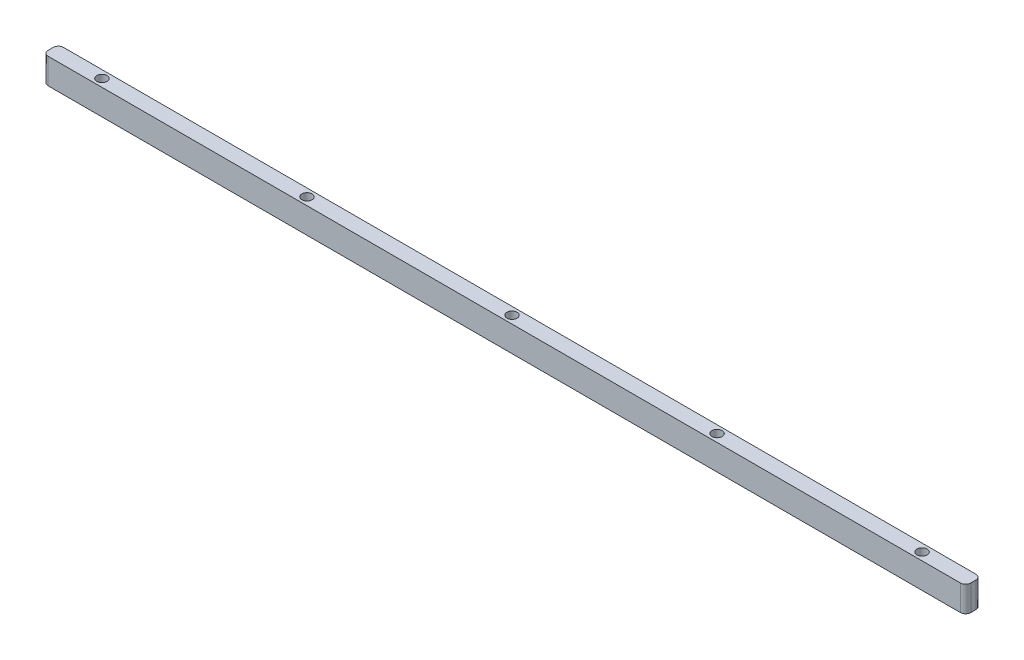
ISO-10303-21;
HEADER;
FILE_DESCRIPTION(('STEP AP214'),'2;1');
FILE_NAME('part.step','',(''),(''),'','','');
FILE_SCHEMA(('AUTOMOTIVE_DESIGN { 1 0 10303 214 1 1 1 1 }'));
ENDSEC;
DATA;
#1=APPLICATION_CONTEXT('core data for automotive mechanical design processes');
#2=APPLICATION_PROTOCOL_DEFINITION('international standard','automotive_design',2000,#1);
#3=PRODUCT_CONTEXT('',#1,'mechanical');
#4=PRODUCT('Part','Part','',(#3));
#5=PRODUCT_RELATED_PRODUCT_CATEGORY('part','',(#4));
#6=PRODUCT_DEFINITION_FORMATION('','',#4);
#7=PRODUCT_DEFINITION_CONTEXT('part definition',#1,'design');
#8=PRODUCT_DEFINITION('design','',#6,#7);
#9=PRODUCT_DEFINITION_SHAPE('','',#8);
#10=(LENGTH_UNIT() NAMED_UNIT(*) SI_UNIT(.MILLI.,.METRE.));
#11=(NAMED_UNIT(*) PLANE_ANGLE_UNIT() SI_UNIT($,.RADIAN.));
#12=(NAMED_UNIT(*) SI_UNIT($,.STERADIAN.) SOLID_ANGLE_UNIT());
#13=UNCERTAINTY_MEASURE_WITH_UNIT(LENGTH_MEASURE(1.E-05),#10,'distance_accuracy_value','');
#14=(GEOMETRIC_REPRESENTATION_CONTEXT(3) GLOBAL_UNCERTAINTY_ASSIGNED_CONTEXT((#13)) GLOBAL_UNIT_ASSIGNED_CONTEXT((#10,
#11,#12)) REPRESENTATION_CONTEXT('',''));
#15=CARTESIAN_POINT('',(0.,0.,0.));
#16=DIRECTION('',(0.,0.,1.));
#17=DIRECTION('',(1.,0.,0.));
#18=AXIS2_PLACEMENT_3D('',#15,#16,#17);
#19=CARTESIAN_POINT('',(0.,5.,-1.5));
#20=DIRECTION('',(0.,0.,-1.));
#21=DIRECTION('',(-1.,0.,0.));
#22=AXIS2_PLACEMENT_3D('',#19,#20,#21);
#23=PLANE('',#22);
#24=DIRECTION('',(1.,0.,0.));
#25=VECTOR('',#24,1.);
#26=CARTESIAN_POINT('',(0.,5.,-1.5));
#27=LINE('',#26,#25);
#28=CARTESIAN_POINT('',(-89.,5.,-1.5));
#29=VERTEX_POINT('',#28);
#30=CARTESIAN_POINT('',(89.,5.,-1.5));
#31=VERTEX_POINT('',#30);
#32=EDGE_CURVE('E513',#29,#31,#27,.T.);
#33=ORIENTED_EDGE('',*,*,#32,.T.);
#34=DIRECTION('',(0.,-1.,0.));
#35=VECTOR('',#34,1.);
#36=CARTESIAN_POINT('',(89.,0.,-1.5));
#37=LINE('',#36,#35);
#38=CARTESIAN_POINT('',(89.,0.,-1.5));
#39=VERTEX_POINT('',#38);
#40=EDGE_CURVE('E214',#31,#39,#37,.T.);
#41=ORIENTED_EDGE('',*,*,#40,.T.);
#42=DIRECTION('',(1.,0.,0.));
#43=VECTOR('',#42,1.);
#44=CARTESIAN_POINT('',(0.,0.,-1.5));
#45=LINE('',#44,#43);
#46=CARTESIAN_POINT('',(-89.,0.,-1.5));
#47=VERTEX_POINT('',#46);
#48=EDGE_CURVE('E201',#47,#39,#45,.T.);
#49=ORIENTED_EDGE('',*,*,#48,.F.);
#50=DIRECTION('',(0.,-1.,0.));
#51=VECTOR('',#50,1.);
#52=CARTESIAN_POINT('',(-89.,5.,-1.5));
#53=LINE('',#52,#51);
#54=EDGE_CURVE('E212',#47,#29,#53,.F.);
#55=ORIENTED_EDGE('',*,*,#54,.T.);
#56=EDGE_LOOP('',(#33,#41,#49,#55));
#57=FACE_BOUND('',#56,.T.);
#58=ADVANCED_FACE('F131',(#57),#23,.T.);
#59=CARTESIAN_POINT('',(-90.,5.,0.));
#60=DIRECTION('',(-1.,0.,0.));
#61=DIRECTION('',(0.,0.,1.));
#62=AXIS2_PLACEMENT_3D('',#59,#60,#61);
#63=PLANE('',#62);
#64=DIRECTION('',(0.,0.,-1.));
#65=VECTOR('',#64,1.);
#66=CARTESIAN_POINT('',(-90.,5.,0.));
#67=LINE('',#66,#65);
#68=CARTESIAN_POINT('',(-90.,5.,0.5));
#69=VERTEX_POINT('',#68);
#70=CARTESIAN_POINT('',(-90.,5.,-0.5));
#71=VERTEX_POINT('',#70);
#72=EDGE_CURVE('E222',#69,#71,#67,.T.);
#73=ORIENTED_EDGE('',*,*,#72,.T.);
#74=DIRECTION('',(0.,-1.,0.));
#75=VECTOR('',#74,1.);
#76=CARTESIAN_POINT('',(-90.,5.,-0.5));
#77=LINE('',#76,#75);
#78=CARTESIAN_POINT('',(-90.,0.,-0.5));
#79=VERTEX_POINT('',#78);
#80=EDGE_CURVE('E12',#71,#79,#77,.T.);
#81=ORIENTED_EDGE('',*,*,#80,.T.);
#82=DIRECTION('',(0.,0.,-1.));
#83=VECTOR('',#82,1.);
#84=CARTESIAN_POINT('',(-90.,0.,0.));
#85=LINE('',#84,#83);
#86=CARTESIAN_POINT('',(-90.,0.,0.5));
#87=VERTEX_POINT('',#86);
#88=EDGE_CURVE('E202',#87,#79,#85,.T.);
#89=ORIENTED_EDGE('',*,*,#88,.F.);
#90=DIRECTION('',(0.,-1.,0.));
#91=VECTOR('',#90,1.);
#92=CARTESIAN_POINT('',(-90.,5.,0.5));
#93=LINE('',#92,#91);
#94=EDGE_CURVE('E139',#87,#69,#93,.F.);
#95=ORIENTED_EDGE('',*,*,#94,.T.);
#96=EDGE_LOOP('',(#73,#81,#89,#95));
#97=FACE_BOUND('',#96,.T.);
#98=ADVANCED_FACE('F308',(#97),#63,.T.);
#99=CARTESIAN_POINT('',(0.,5.,1.5));
#100=DIRECTION('',(0.,0.,-1.));
#101=DIRECTION('',(-1.,0.,0.));
#102=AXIS2_PLACEMENT_3D('',#99,#100,#101);
#103=PLANE('',#102);
#104=DIRECTION('',(1.,0.,0.));
#105=VECTOR('',#104,1.);
#106=CARTESIAN_POINT('',(0.,0.,1.5));
#107=LINE('',#106,#105);
#108=CARTESIAN_POINT('',(-89.,0.,1.5));
#109=VERTEX_POINT('',#108);
#110=CARTESIAN_POINT('',(89.,0.,1.5));
#111=VERTEX_POINT('',#110);
#112=EDGE_CURVE('E255',#109,#111,#107,.T.);
#113=ORIENTED_EDGE('',*,*,#112,.T.);
#114=DIRECTION('',(0.,-1.,0.));
#115=VECTOR('',#114,1.);
#116=CARTESIAN_POINT('',(89.,5.,1.5));
#117=LINE('',#116,#115);
#118=CARTESIAN_POINT('',(89.,5.,1.5));
#119=VERTEX_POINT('',#118);
#120=EDGE_CURVE('E247',#111,#119,#117,.F.);
#121=ORIENTED_EDGE('',*,*,#120,.T.);
#122=DIRECTION('',(1.,0.,0.));
#123=VECTOR('',#122,1.);
#124=CARTESIAN_POINT('',(0.,5.,1.5));
#125=LINE('',#124,#123);
#126=CARTESIAN_POINT('',(-89.,5.,1.5));
#127=VERTEX_POINT('',#126);
#128=EDGE_CURVE('E218',#127,#119,#125,.T.);
#129=ORIENTED_EDGE('',*,*,#128,.F.);
#130=DIRECTION('',(0.,-1.,0.));
#131=VECTOR('',#130,1.);
#132=CARTESIAN_POINT('',(-89.,0.,1.5));
#133=LINE('',#132,#131);
#134=EDGE_CURVE('E244',#127,#109,#133,.T.);
#135=ORIENTED_EDGE('',*,*,#134,.T.);
#136=EDGE_LOOP('',(#113,#121,#129,#135));
#137=FACE_BOUND('',#136,.T.);
#138=ADVANCED_FACE('F252',(#137),#103,.F.);
#139=CARTESIAN_POINT('',(-40.,5.,0.));
#140=DIRECTION('',(0.,-1.,0.));
#141=DIRECTION('',(0.,0.,-1.));
#142=AXIS2_PLACEMENT_3D('',#139,#140,#141);
#143=CYLINDRICAL_SURFACE('',#142,0.999999999999998);
#144=CARTESIAN_POINT('',(-40.,5.,0.));
#145=DIRECTION('',(0.,1.,0.));
#146=DIRECTION('',(0.,0.,1.));
#147=AXIS2_PLACEMENT_3D('',#144,#145,#146);
#148=CIRCLE('',#147,0.999999999999998);
#149=CARTESIAN_POINT('',(-40.,5.,0.999999999999998));
#150=VERTEX_POINT('',#149);
#151=EDGE_CURVE('E500',#150,#150,#148,.T.);
#152=ORIENTED_EDGE('',*,*,#151,.T.);
#153=EDGE_LOOP('',(#152));
#154=FACE_BOUND('',#153,.T.);
#155=CARTESIAN_POINT('',(-40.,0.,0.));
#156=DIRECTION('',(0.,1.,0.));
#157=DIRECTION('',(0.,0.,1.));
#158=AXIS2_PLACEMENT_3D('',#155,#156,#157);
#159=CIRCLE('',#158,0.999999999999998);
#160=CARTESIAN_POINT('',(-40.,0.,0.999999999999998));
#161=VERTEX_POINT('',#160);
#162=EDGE_CURVE('E215',#161,#161,#159,.T.);
#163=ORIENTED_EDGE('',*,*,#162,.F.);
#164=EDGE_LOOP('',(#163));
#165=FACE_BOUND('',#164,.T.);
#166=ADVANCED_FACE('F316',(#154,#165),#143,.F.);
#167=CARTESIAN_POINT('',(-80.,5.,0.));
#168=DIRECTION('',(0.,-1.,0.));
#169=DIRECTION('',(0.,0.,-1.));
#170=AXIS2_PLACEMENT_3D('',#167,#168,#169);
#171=CYLINDRICAL_SURFACE('',#170,0.999999999999998);
#172=CARTESIAN_POINT('',(-80.,5.,0.));
#173=DIRECTION('',(0.,1.,0.));
#174=DIRECTION('',(0.,0.,1.));
#175=AXIS2_PLACEMENT_3D('',#172,#173,#174);
#176=CIRCLE('',#175,0.999999999999998);
#177=CARTESIAN_POINT('',(-80.,5.,0.999999999999998));
#178=VERTEX_POINT('',#177);
#179=EDGE_CURVE('E497',#178,#178,#176,.T.);
#180=ORIENTED_EDGE('',*,*,#179,.T.);
#181=EDGE_LOOP('',(#180));
#182=FACE_BOUND('',#181,.T.);
#183=CARTESIAN_POINT('',(-80.,0.,0.));
#184=DIRECTION('',(0.,1.,0.));
#185=DIRECTION('',(0.,0.,1.));
#186=AXIS2_PLACEMENT_3D('',#183,#184,#185);
#187=CIRCLE('',#186,0.999999999999998);
#188=CARTESIAN_POINT('',(-80.,0.,0.999999999999998));
#189=VERTEX_POINT('',#188);
#190=EDGE_CURVE('E505',#189,#189,#187,.T.);
#191=ORIENTED_EDGE('',*,*,#190,.F.);
#192=EDGE_LOOP('',(#191));
#193=FACE_BOUND('',#192,.T.);
#194=ADVANCED_FACE('F319',(#182,#193),#171,.F.);
#195=CARTESIAN_POINT('',(0.,0.,0.));
#196=DIRECTION('',(0.,1.,0.));
#197=DIRECTION('',(0.,0.,1.));
#198=AXIS2_PLACEMENT_3D('',#195,#196,#197);
#199=PLANE('',#198);
#200=ORIENTED_EDGE('',*,*,#190,.T.);
#201=EDGE_LOOP('',(#200));
#202=FACE_BOUND('',#201,.T.);
#203=ORIENTED_EDGE('',*,*,#162,.T.);
#204=EDGE_LOOP('',(#203));
#205=FACE_BOUND('',#204,.T.);
#206=ORIENTED_EDGE('',*,*,#48,.T.);
#207=CARTESIAN_POINT('',(89.,0.,-0.5));
#208=DIRECTION('',(0.,1.,0.));
#209=DIRECTION('',(0.,0.,1.));
#210=AXIS2_PLACEMENT_3D('',#207,#208,#209);
#211=CIRCLE('',#210,1.);
#212=CARTESIAN_POINT('',(90.,0.,-0.5));
#213=VERTEX_POINT('',#212);
#214=EDGE_CURVE('E230',#39,#213,#211,.F.);
#215=ORIENTED_EDGE('',*,*,#214,.T.);
#216=DIRECTION('',(0.,0.,-1.));
#217=VECTOR('',#216,1.);
#218=CARTESIAN_POINT('',(90.,0.,0.));
#219=LINE('',#218,#217);
#220=CARTESIAN_POINT('',(90.,0.,0.5));
#221=VERTEX_POINT('',#220);
#222=EDGE_CURVE('E269',#221,#213,#219,.T.);
#223=ORIENTED_EDGE('',*,*,#222,.F.);
#224=CARTESIAN_POINT('',(89.,0.,0.5));
#225=DIRECTION('',(0.,1.,0.));
#226=DIRECTION('',(0.,0.,1.));
#227=AXIS2_PLACEMENT_3D('',#224,#225,#226);
#228=CIRCLE('',#227,1.);
#229=EDGE_CURVE('E206',#221,#111,#228,.F.);
#230=ORIENTED_EDGE('',*,*,#229,.T.);
#231=ORIENTED_EDGE('',*,*,#112,.F.);
#232=CARTESIAN_POINT('',(-89.,0.,0.5));
#233=DIRECTION('',(0.,1.,0.));
#234=DIRECTION('',(0.,0.,1.));
#235=AXIS2_PLACEMENT_3D('',#232,#233,#234);
#236=CIRCLE('',#235,1.);
#237=EDGE_CURVE('E207',#109,#87,#236,.F.);
#238=ORIENTED_EDGE('',*,*,#237,.T.);
#239=ORIENTED_EDGE('',*,*,#88,.T.);
#240=CARTESIAN_POINT('',(-89.,0.,-0.5));
#241=DIRECTION('',(0.,1.,0.));
#242=DIRECTION('',(0.,0.,1.));
#243=AXIS2_PLACEMENT_3D('',#240,#241,#242);
#244=CIRCLE('',#243,1.);
#245=EDGE_CURVE('E197',#79,#47,#244,.F.);
#246=ORIENTED_EDGE('',*,*,#245,.T.);
#247=EDGE_LOOP('',(#206,#215,#223,#230,#231,#238,#239,#246));
#248=FACE_BOUND('',#247,.T.);
#249=CARTESIAN_POINT('',(0.,0.,0.));
#250=DIRECTION('',(0.,1.,0.));
#251=DIRECTION('',(0.,0.,1.));
#252=AXIS2_PLACEMENT_3D('',#249,#250,#251);
#253=CIRCLE('',#252,1.);
#254=CARTESIAN_POINT('',(0.,0.,1.));
#255=VERTEX_POINT('',#254);
#256=EDGE_CURVE('E225',#255,#255,#253,.T.);
#257=ORIENTED_EDGE('',*,*,#256,.T.);
#258=EDGE_LOOP('',(#257));
#259=FACE_BOUND('',#258,.T.);
#260=CARTESIAN_POINT('',(80.,0.,0.));
#261=DIRECTION('',(0.,1.,0.));
#262=DIRECTION('',(0.,0.,1.));
#263=AXIS2_PLACEMENT_3D('',#260,#261,#262);
#264=CIRCLE('',#263,0.999999999999998);
#265=CARTESIAN_POINT('',(80.,0.,0.999999999999998));
#266=VERTEX_POINT('',#265);
#267=EDGE_CURVE('E279',#266,#266,#264,.T.);
#268=ORIENTED_EDGE('',*,*,#267,.T.);
#269=EDGE_LOOP('',(#268));
#270=FACE_BOUND('',#269,.T.);
#271=CARTESIAN_POINT('',(40.,0.,0.));
#272=DIRECTION('',(0.,1.,0.));
#273=DIRECTION('',(0.,0.,1.));
#274=AXIS2_PLACEMENT_3D('',#271,#272,#273);
#275=CIRCLE('',#274,0.999999999999998);
#276=CARTESIAN_POINT('',(40.,0.,0.999999999999998));
#277=VERTEX_POINT('',#276);
#278=EDGE_CURVE('E273',#277,#277,#275,.T.);
#279=ORIENTED_EDGE('',*,*,#278,.T.);
#280=EDGE_LOOP('',(#279));
#281=FACE_BOUND('',#280,.T.);
#282=ADVANCED_FACE('F199',(#202,#205,#248,#259,#270,#281),#199,.F.);
#283=CARTESIAN_POINT('',(0.,5.,0.));
#284=DIRECTION('',(0.,1.,0.));
#285=DIRECTION('',(0.,0.,1.));
#286=AXIS2_PLACEMENT_3D('',#283,#284,#285);
#287=PLANE('',#286);
#288=ORIENTED_EDGE('',*,*,#179,.F.);
#289=EDGE_LOOP('',(#288));
#290=FACE_BOUND('',#289,.T.);
#291=ORIENTED_EDGE('',*,*,#151,.F.);
#292=EDGE_LOOP('',(#291));
#293=FACE_BOUND('',#292,.T.);
#294=DIRECTION('',(0.,0.,-1.));
#295=VECTOR('',#294,1.);
#296=CARTESIAN_POINT('',(90.,5.,0.));
#297=LINE('',#296,#295);
#298=CARTESIAN_POINT('',(90.,5.,0.5));
#299=VERTEX_POINT('',#298);
#300=CARTESIAN_POINT('',(90.,5.,-0.5));
#301=VERTEX_POINT('',#300);
#302=EDGE_CURVE('E271',#299,#301,#297,.T.);
#303=ORIENTED_EDGE('',*,*,#302,.T.);
#304=CARTESIAN_POINT('',(89.,5.,-0.5));
#305=DIRECTION('',(0.,1.,0.));
#306=DIRECTION('',(0.,0.,1.));
#307=AXIS2_PLACEMENT_3D('',#304,#305,#306);
#308=CIRCLE('',#307,1.);
#309=EDGE_CURVE('E242',#301,#31,#308,.T.);
#310=ORIENTED_EDGE('',*,*,#309,.T.);
#311=ORIENTED_EDGE('',*,*,#32,.F.);
#312=CARTESIAN_POINT('',(-89.,5.,-0.5));
#313=DIRECTION('',(0.,1.,0.));
#314=DIRECTION('',(0.,0.,1.));
#315=AXIS2_PLACEMENT_3D('',#312,#313,#314);
#316=CIRCLE('',#315,1.);
#317=EDGE_CURVE('E146',#29,#71,#316,.T.);
#318=ORIENTED_EDGE('',*,*,#317,.T.);
#319=ORIENTED_EDGE('',*,*,#72,.F.);
#320=CARTESIAN_POINT('',(-89.,5.,0.5));
#321=DIRECTION('',(0.,1.,0.));
#322=DIRECTION('',(0.,0.,1.));
#323=AXIS2_PLACEMENT_3D('',#320,#321,#322);
#324=CIRCLE('',#323,1.);
#325=EDGE_CURVE('E237',#69,#127,#324,.T.);
#326=ORIENTED_EDGE('',*,*,#325,.T.);
#327=ORIENTED_EDGE('',*,*,#128,.T.);
#328=CARTESIAN_POINT('',(89.,5.,0.5));
#329=DIRECTION('',(0.,1.,0.));
#330=DIRECTION('',(0.,0.,1.));
#331=AXIS2_PLACEMENT_3D('',#328,#329,#330);
#332=CIRCLE('',#331,1.);
#333=EDGE_CURVE('E240',#119,#299,#332,.T.);
#334=ORIENTED_EDGE('',*,*,#333,.T.);
#335=EDGE_LOOP('',(#303,#310,#311,#318,#319,#326,#327,#334));
#336=FACE_BOUND('',#335,.T.);
#337=CARTESIAN_POINT('',(0.,5.,0.));
#338=DIRECTION('',(0.,1.,0.));
#339=DIRECTION('',(0.,0.,1.));
#340=AXIS2_PLACEMENT_3D('',#337,#338,#339);
#341=CIRCLE('',#340,1.);
#342=CARTESIAN_POINT('',(0.,5.,1.));
#343=VERTEX_POINT('',#342);
#344=EDGE_CURVE('E282',#343,#343,#341,.T.);
#345=ORIENTED_EDGE('',*,*,#344,.F.);
#346=EDGE_LOOP('',(#345));
#347=FACE_BOUND('',#346,.T.);
#348=CARTESIAN_POINT('',(80.,5.,0.));
#349=DIRECTION('',(0.,1.,0.));
#350=DIRECTION('',(0.,0.,1.));
#351=AXIS2_PLACEMENT_3D('',#348,#349,#350);
#352=CIRCLE('',#351,0.999999999999998);
#353=CARTESIAN_POINT('',(80.,5.,0.999999999999998));
#354=VERTEX_POINT('',#353);
#355=EDGE_CURVE('E272',#354,#354,#352,.T.);
#356=ORIENTED_EDGE('',*,*,#355,.F.);
#357=EDGE_LOOP('',(#356));
#358=FACE_BOUND('',#357,.T.);
#359=CARTESIAN_POINT('',(40.,5.,0.));
#360=DIRECTION('',(0.,1.,0.));
#361=DIRECTION('',(0.,0.,1.));
#362=AXIS2_PLACEMENT_3D('',#359,#360,#361);
#363=CIRCLE('',#362,0.999999999999998);
#364=CARTESIAN_POINT('',(40.,5.,0.999999999999998));
#365=VERTEX_POINT('',#364);
#366=EDGE_CURVE('E276',#365,#365,#363,.T.);
#367=ORIENTED_EDGE('',*,*,#366,.F.);
#368=EDGE_LOOP('',(#367));
#369=FACE_BOUND('',#368,.T.);
#370=ADVANCED_FACE('F259',(#290,#293,#336,#347,#358,#369),#287,.T.);
#371=CARTESIAN_POINT('',(40.,5.,0.));
#372=DIRECTION('',(0.,-1.,0.));
#373=DIRECTION('',(0.,0.,-1.));
#374=AXIS2_PLACEMENT_3D('',#371,#372,#373);
#375=CYLINDRICAL_SURFACE('',#374,0.999999999999998);
#376=ORIENTED_EDGE('',*,*,#366,.T.);
#377=EDGE_LOOP('',(#376));
#378=FACE_BOUND('',#377,.T.);
#379=ORIENTED_EDGE('',*,*,#278,.F.);
#380=EDGE_LOOP('',(#379));
#381=FACE_BOUND('',#380,.T.);
#382=ADVANCED_FACE('F303',(#378,#381),#375,.F.);
#383=CARTESIAN_POINT('',(80.,5.,0.));
#384=DIRECTION('',(0.,-1.,0.));
#385=DIRECTION('',(0.,0.,-1.));
#386=AXIS2_PLACEMENT_3D('',#383,#384,#385);
#387=CYLINDRICAL_SURFACE('',#386,0.999999999999998);
#388=ORIENTED_EDGE('',*,*,#355,.T.);
#389=EDGE_LOOP('',(#388));
#390=FACE_BOUND('',#389,.T.);
#391=ORIENTED_EDGE('',*,*,#267,.F.);
#392=EDGE_LOOP('',(#391));
#393=FACE_BOUND('',#392,.T.);
#394=ADVANCED_FACE('F295',(#390,#393),#387,.F.);
#395=CARTESIAN_POINT('',(90.,5.,0.));
#396=DIRECTION('',(-1.,0.,0.));
#397=DIRECTION('',(0.,0.,1.));
#398=AXIS2_PLACEMENT_3D('',#395,#396,#397);
#399=PLANE('',#398);
#400=ORIENTED_EDGE('',*,*,#222,.T.);
#401=DIRECTION('',(0.,-1.,0.));
#402=VECTOR('',#401,1.);
#403=CARTESIAN_POINT('',(90.,5.,-0.5));
#404=LINE('',#403,#402);
#405=EDGE_CURVE('E235',#213,#301,#404,.F.);
#406=ORIENTED_EDGE('',*,*,#405,.T.);
#407=ORIENTED_EDGE('',*,*,#302,.F.);
#408=DIRECTION('',(0.,-1.,0.));
#409=VECTOR('',#408,1.);
#410=CARTESIAN_POINT('',(90.,5.,0.5));
#411=LINE('',#410,#409);
#412=EDGE_CURVE('E232',#299,#221,#411,.T.);
#413=ORIENTED_EDGE('',*,*,#412,.T.);
#414=EDGE_LOOP('',(#400,#406,#407,#413));
#415=FACE_BOUND('',#414,.T.);
#416=ADVANCED_FACE('F268',(#415),#399,.F.);
#417=CARTESIAN_POINT('',(0.,5.,0.));
#418=DIRECTION('',(0.,-1.,0.));
#419=DIRECTION('',(0.,0.,-1.));
#420=AXIS2_PLACEMENT_3D('',#417,#418,#419);
#421=CYLINDRICAL_SURFACE('',#420,1.);
#422=ORIENTED_EDGE('',*,*,#344,.T.);
#423=EDGE_LOOP('',(#422));
#424=FACE_BOUND('',#423,.T.);
#425=ORIENTED_EDGE('',*,*,#256,.F.);
#426=EDGE_LOOP('',(#425));
#427=FACE_BOUND('',#426,.T.);
#428=ADVANCED_FACE('F291',(#424,#427),#421,.F.);
#429=CARTESIAN_POINT('',(89.,5.,-0.5));
#430=DIRECTION('',(0.,1.,0.));
#431=DIRECTION('',(0.,0.,1.));
#432=AXIS2_PLACEMENT_3D('',#429,#430,#431);
#433=CYLINDRICAL_SURFACE('',#432,1.);
#434=ORIENTED_EDGE('',*,*,#309,.F.);
#435=ORIENTED_EDGE('',*,*,#405,.F.);
#436=ORIENTED_EDGE('',*,*,#214,.F.);
#437=ORIENTED_EDGE('',*,*,#40,.F.);
#438=EDGE_LOOP('',(#434,#435,#436,#437));
#439=FACE_BOUND('',#438,.T.);
#440=ADVANCED_FACE('F293',(#439),#433,.T.);
#441=CARTESIAN_POINT('',(89.,5.,0.5));
#442=DIRECTION('',(0.,-1.,0.));
#443=DIRECTION('',(0.,0.,-1.));
#444=AXIS2_PLACEMENT_3D('',#441,#442,#443);
#445=CYLINDRICAL_SURFACE('',#444,1.);
#446=ORIENTED_EDGE('',*,*,#333,.F.);
#447=ORIENTED_EDGE('',*,*,#120,.F.);
#448=ORIENTED_EDGE('',*,*,#229,.F.);
#449=ORIENTED_EDGE('',*,*,#412,.F.);
#450=EDGE_LOOP('',(#446,#447,#448,#449));
#451=FACE_BOUND('',#450,.T.);
#452=ADVANCED_FACE('F264',(#451),#445,.T.);
#453=CARTESIAN_POINT('',(-89.,5.,-0.5));
#454=DIRECTION('',(0.,-1.,0.));
#455=DIRECTION('',(0.,0.,-1.));
#456=AXIS2_PLACEMENT_3D('',#453,#454,#455);
#457=CYLINDRICAL_SURFACE('',#456,1.);
#458=ORIENTED_EDGE('',*,*,#317,.F.);
#459=ORIENTED_EDGE('',*,*,#54,.F.);
#460=ORIENTED_EDGE('',*,*,#245,.F.);
#461=ORIENTED_EDGE('',*,*,#80,.F.);
#462=EDGE_LOOP('',(#458,#459,#460,#461));
#463=FACE_BOUND('',#462,.T.);
#464=ADVANCED_FACE('F217',(#463),#457,.T.);
#465=CARTESIAN_POINT('',(-89.,5.,0.5));
#466=DIRECTION('',(0.,1.,0.));
#467=DIRECTION('',(0.,0.,1.));
#468=AXIS2_PLACEMENT_3D('',#465,#466,#467);
#469=CYLINDRICAL_SURFACE('',#468,1.);
#470=ORIENTED_EDGE('',*,*,#325,.F.);
#471=ORIENTED_EDGE('',*,*,#94,.F.);
#472=ORIENTED_EDGE('',*,*,#237,.F.);
#473=ORIENTED_EDGE('',*,*,#134,.F.);
#474=EDGE_LOOP('',(#470,#471,#472,#473));
#475=FACE_BOUND('',#474,.T.);
#476=ADVANCED_FACE('F133',(#475),#469,.T.);
#477=CLOSED_SHELL('',(#58,#98,#138,#166,#194,#282,#370,#382,#394,#416,#428,#440,#452,#464,#476));
#478=MANIFOLD_SOLID_BREP('B2',#477);
#479=ADVANCED_BREP_SHAPE_REPRESENTATION('',(#18,#478),#14);
#480=SHAPE_DEFINITION_REPRESENTATION(#9,#479);
ENDSEC;
END-ISO-10303-21;
